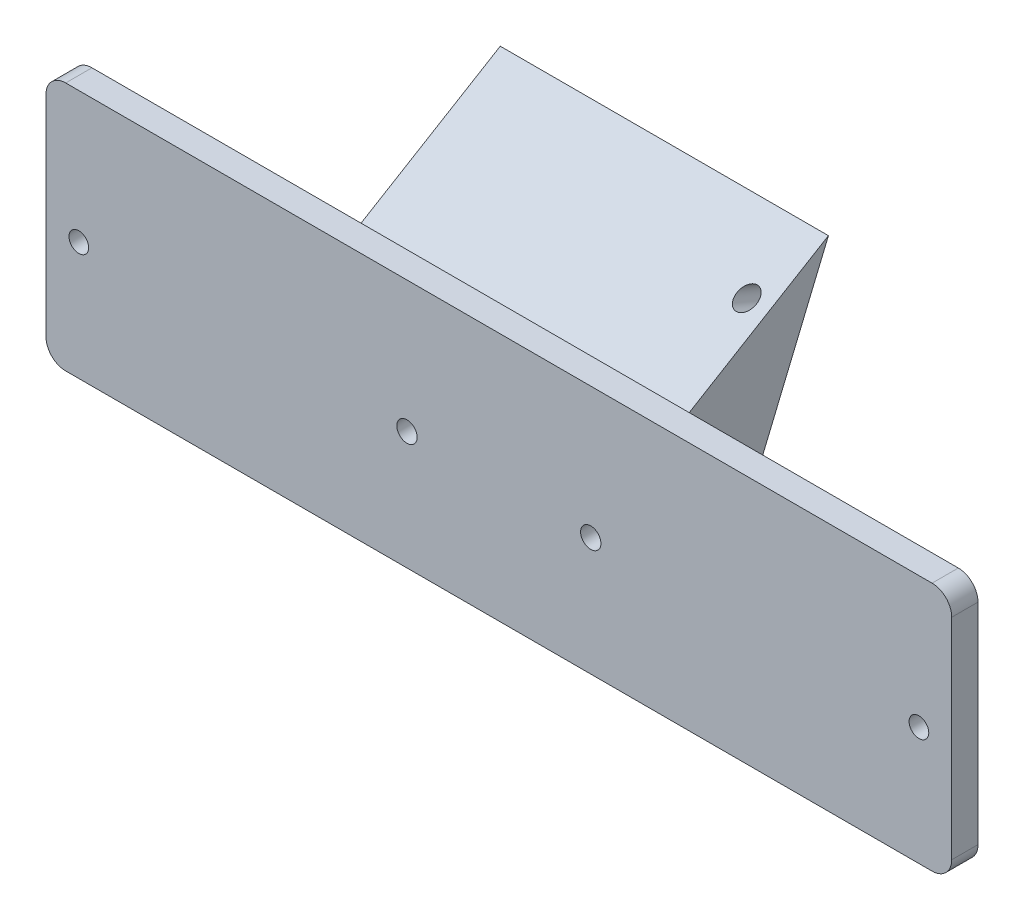
ISO-10303-21;
HEADER;
FILE_DESCRIPTION(('STEP AP214'),'2;1');
FILE_NAME('part.step','',(''),(''),'','','');
FILE_SCHEMA(('AUTOMOTIVE_DESIGN { 1 0 10303 214 1 1 1 1 }'));
ENDSEC;
DATA;
#1=APPLICATION_CONTEXT('core data for automotive mechanical design processes');
#2=APPLICATION_PROTOCOL_DEFINITION('international standard','automotive_design',2000,#1);
#3=PRODUCT_CONTEXT('',#1,'mechanical');
#4=PRODUCT('Part','Part','',(#3));
#5=PRODUCT_RELATED_PRODUCT_CATEGORY('part','',(#4));
#6=PRODUCT_DEFINITION_FORMATION('','',#4);
#7=PRODUCT_DEFINITION_CONTEXT('part definition',#1,'design');
#8=PRODUCT_DEFINITION('design','',#6,#7);
#9=PRODUCT_DEFINITION_SHAPE('','',#8);
#10=(LENGTH_UNIT() NAMED_UNIT(*) SI_UNIT(.MILLI.,.METRE.));
#11=(NAMED_UNIT(*) PLANE_ANGLE_UNIT() SI_UNIT($,.RADIAN.));
#12=(NAMED_UNIT(*) SI_UNIT($,.STERADIAN.) SOLID_ANGLE_UNIT());
#13=UNCERTAINTY_MEASURE_WITH_UNIT(LENGTH_MEASURE(1.E-05),#10,'distance_accuracy_value','');
#14=(GEOMETRIC_REPRESENTATION_CONTEXT(3) GLOBAL_UNCERTAINTY_ASSIGNED_CONTEXT((#13)) GLOBAL_UNIT_ASSIGNED_CONTEXT((#10,
#11,#12)) REPRESENTATION_CONTEXT('',''));
#15=CARTESIAN_POINT('',(0.,0.,0.));
#16=DIRECTION('',(0.,0.,1.));
#17=DIRECTION('',(1.,0.,0.));
#18=AXIS2_PLACEMENT_3D('',#15,#16,#17);
#19=CARTESIAN_POINT('',(14.,-1.00000000000002,-14.));
#20=DIRECTION('',(0.,0.,1.));
#21=DIRECTION('',(1.,0.,0.));
#22=AXIS2_PLACEMENT_3D('',#19,#20,#21);
#23=CYLINDRICAL_SURFACE('',#22,4.);
#24=CARTESIAN_POINT('',(14.,-1.00000000000002,-7.52401281736873));
#25=DIRECTION('',(0.,-0.385663901816188,-0.922639341690952));
#26=DIRECTION('',(0.,-0.922639341690952,0.385663901816188));
#27=AXIS2_PLACEMENT_3D('',#24,#25,#26);
#28=ELLIPSE('',#27,4.33538850908857,4.);
#29=CARTESIAN_POINT('',(14.,-5.00000000000002,-5.85200996906457));
#30=VERTEX_POINT('',#29);
#31=EDGE_CURVE('E245',#30,#30,#28,.T.);
#32=ORIENTED_EDGE('',*,*,#31,.T.);
#33=EDGE_LOOP('',(#32));
#34=FACE_BOUND('',#33,.T.);
#35=CARTESIAN_POINT('',(13.548857522689,-4.97447738264615,0.));
#36=CARTESIAN_POINT('',(13.5508289934858,-4.97468866420865,-0.135695678189096));
#37=CARTESIAN_POINT('',(13.5502356291193,-4.97463159092735,-0.271441588218893));
#38=CARTESIAN_POINT('',(13.5435951268503,-4.97388131099325,-0.542924316141424));
#39=CARTESIAN_POINT('',(13.5375428347743,-4.97318750314186,-0.678661004174361));
#40=CARTESIAN_POINT('',(13.5195823218966,-4.97105487501132,-0.950866301817778));
#41=CARTESIAN_POINT('',(13.5076266389618,-4.96961001133758,-1.08733182496762));
#42=CARTESIAN_POINT('',(13.4771804617153,-4.96571502150153,-1.35946274120574));
#43=CARTESIAN_POINT('',(13.4586928024603,-4.9632653313873,-1.49512845550229));
#44=CARTESIAN_POINT('',(13.4126553341946,-4.95671887891971,-1.77395237818587));
#45=CARTESIAN_POINT('',(13.3845974935782,-4.95252598476532,-1.91702879459859));
#46=CARTESIAN_POINT('',(13.3341929359118,-4.94423374129124,-2.12950783379239));
#47=CARTESIAN_POINT('',(13.3160169587779,-4.94113801507408,-2.1999414570889));
#48=CARTESIAN_POINT('',(13.2763585935264,-4.93405045428112,-2.33981844774629));
#49=CARTESIAN_POINT('',(13.2548772401017,-4.93005889995068,-2.40926211758817));
#50=CARTESIAN_POINT('',(13.2049759248958,-4.92028867770833,-2.55514629751047));
#51=CARTESIAN_POINT('',(13.1760276623927,-4.91435065927322,-2.63139775939005));
#52=CARTESIAN_POINT('',(13.1113719007689,-4.90018705562004,-2.78083728416944));
#53=CARTESIAN_POINT('',(13.0756708688848,-4.89196365564132,-2.8540281969763));
#54=CARTESIAN_POINT('',(13.0115504810974,-4.87602194308785,-2.96503383372171));
#55=CARTESIAN_POINT('',(12.9863243816257,-4.86952909498467,-3.00484854506988));
#56=CARTESIAN_POINT('',(12.9316812797524,-4.85480256264338,-3.0812088140369));
#57=CARTESIAN_POINT('',(12.9022690584792,-4.84657085929455,-3.11775802483608));
#58=CARTESIAN_POINT('',(12.8486863764008,-4.83079337441657,-3.17427085002743));
#59=CARTESIAN_POINT('',(12.8259429037748,-4.82390216956617,-3.19575186105137));
#60=CARTESIAN_POINT('',(12.7778351342796,-4.80879855273373,-3.23502108843322));
#61=CARTESIAN_POINT('',(12.7524758338314,-4.80058864344554,-3.25281615648946));
#62=CARTESIAN_POINT('',(12.7052873761329,-4.78473097665914,-3.27972678703418));
#63=CARTESIAN_POINT('',(12.6839665804758,-4.77737983433383,-3.28989585554295));
#64=CARTESIAN_POINT('',(12.6401673017082,-4.7618336873964,-3.30634972981019));
#65=CARTESIAN_POINT('',(12.6176903361921,-4.75363977555732,-3.3126394933811));
#66=CARTESIAN_POINT('',(12.5721032621388,-4.73653645598424,-3.32085578683037));
#67=CARTESIAN_POINT('',(12.5489910093077,-4.72762435834528,-3.32276504114623));
#68=CARTESIAN_POINT('',(12.5029816736419,-4.70938679809966,-3.32217572773031));
#69=CARTESIAN_POINT('',(12.480084821932,-4.7000609419037,-3.3196728713573));
#70=CARTESIAN_POINT('',(12.4302348487773,-4.67922789673592,-3.30977646023281));
#71=CARTESIAN_POINT('',(12.4034879942459,-4.66768913757895,-3.30143415361625));
#72=CARTESIAN_POINT('',(12.3518000943537,-4.64475536673794,-3.28024340163977));
#73=CARTESIAN_POINT('',(12.3268624442596,-4.63336065685782,-3.26738673548343));
#74=CARTESIAN_POINT('',(12.2624385180174,-4.60317620985692,-3.22846873755759));
#75=CARTESIAN_POINT('',(12.2246740301995,-4.58466179431027,-3.19939178721659));
#76=CARTESIAN_POINT('',(12.1536191076803,-4.54858707426575,-3.1357398804736));
#77=CARTESIAN_POINT('',(12.1203440986552,-4.53103017696242,-3.10114681660133));
#78=CARTESIAN_POINT('',(12.0425826695868,-4.48873878976479,-3.01156043327986));
#79=CARTESIAN_POINT('',(12.0001340303818,-4.46448903419513,-2.95459452015534));
#80=CARTESIAN_POINT('',(11.9205791358987,-4.41732895754569,-2.83647277381761));
#81=CARTESIAN_POINT('',(11.8834853836926,-4.39442184309761,-2.7753076114966));
#82=CARTESIAN_POINT('',(11.8129717481283,-4.34942860851124,-2.64969753127713));
#83=CARTESIAN_POINT('',(11.7795945275513,-4.32735363361262,-2.58522492049222));
#84=CARTESIAN_POINT('',(11.7160805784369,-4.28408019429434,-2.45453741456654));
#85=CARTESIAN_POINT('',(11.6859402653108,-4.26288077662987,-2.38832454993401));
#86=CARTESIAN_POINT('',(11.6161509513254,-4.2124476717109,-2.22662663090242));
#87=CARTESIAN_POINT('',(11.5777953178162,-4.18356079543308,-2.13047770845679));
#88=CARTESIAN_POINT('',(11.5050292623399,-4.12685804056314,-1.93637563948792));
#89=CARTESIAN_POINT('',(11.470620075752,-4.09904249913711,-1.83842193908136));
#90=CARTESIAN_POINT('',(11.4049253660648,-4.0442437129652,-1.64102425792748));
#91=CARTESIAN_POINT('',(11.3736460137535,-4.01726218218666,-1.54157776104571));
#92=CARTESIAN_POINT('',(11.3137418539156,-3.96405475770039,-1.34168698729726));
#93=CARTESIAN_POINT('',(11.285117199499,-3.93782890763669,-1.24124265324965));
#94=CARTESIAN_POINT('',(11.231955968682,-3.88776288869805,-1.04625860411516));
#95=CARTESIAN_POINT('',(11.2072741648165,-3.86387987866721,-0.951769266167051));
#96=CARTESIAN_POINT('',(11.1596417098097,-3.81664503004408,-0.762219624701112));
#97=CARTESIAN_POINT('',(11.1366911385143,-3.79329321598565,-0.667159295066688));
#98=CARTESIAN_POINT('',(11.0924282544889,-3.74718844449116,-0.476977131696383));
#99=CARTESIAN_POINT('',(11.0711092201527,-3.7244333158064,-0.381857382526275));
#100=CARTESIAN_POINT('',(11.0298589223531,-3.67940080046702,-0.191216861172352));
#101=CARTESIAN_POINT('',(11.0099274939587,-3.65712335725319,-0.0956961380843129));
#102=CARTESIAN_POINT('',(10.9906173019458,-3.63507415012405,0.));
#103=B_SPLINE_CURVE_WITH_KNOTS('',3,(#35,#36,#37,#38,#39,#40,#41,#42,#43,#44,#45,#46,#47,#48,
#49,#50,#51,#52,#53,#54,#55,#56,#57,#58,#59,#60,#61,#62,#63,#64,#65,#66,#67,#68,#69,#70,#71,#72,
#73,#74,#75,#76,#77,#78,#79,#80,#81,#82,#83,#84,#85,#86,#87,#88,#89,#90,#91,#92,#93,#94,#95,#96,
#97,#98,#99,#100,#101,#102),.UNSPECIFIED.,.F.,.F.,(4,2,2,2,2,2,2,2,2,2,2,2,2,2,2,2,2,2,2,2,2,2,
2,2,2,2,2,2,2,2,2,2,2,4),(0.,0.407123518449141,0.814631834881879,1.22547113499973,
1.63613233821117,2.07330802279186,2.29166435922415,2.50995248138173,2.75506938843174,
2.99995272090053,3.14248382974126,3.28485343564211,3.3807086508683,3.47638405191943,
3.55030564697157,3.62413257223935,3.69825015445158,3.77243981985319,3.86283262508824,
3.9533908996504,4.10591795758554,4.2589564259962,4.48359152200211,4.70874291508251,
4.93625827502425,5.16351902574743,5.48580029948024,5.80818218500554,6.13118764817672,
6.45421172915004,6.75580489173056,7.05741195555207,7.35770084940138,7.65795398970193),.UNSPECIFIED.);
#104=CARTESIAN_POINT('',(13.548857522689,-4.97447738264613,0.));
#105=VERTEX_POINT('',#104);
#106=CARTESIAN_POINT('',(10.9906173019458,-3.63507415012401,0.));
#107=VERTEX_POINT('',#106);
#108=EDGE_CURVE('E47',#105,#107,#103,.T.);
#109=ORIENTED_EDGE('',*,*,#108,.F.);
#110=CARTESIAN_POINT('',(14.,-1.00000000000002,0.));
#111=DIRECTION('',(0.,0.,1.));
#112=DIRECTION('',(1.,0.,0.));
#113=AXIS2_PLACEMENT_3D('',#110,#111,#112);
#114=CIRCLE('',#113,4.);
#115=EDGE_CURVE('E125',#105,#107,#114,.T.);
#116=ORIENTED_EDGE('',*,*,#115,.T.);
#117=EDGE_LOOP('',(#109,#116));
#118=FACE_BOUND('',#117,.T.);
#119=ADVANCED_FACE('F33',(#34,#118),#23,.F.);
#120=CARTESIAN_POINT('',(-14.,-0.999999999999997,48.));
#121=DIRECTION('',(0.,0.,-1.));
#122=DIRECTION('',(-1.,0.,0.));
#123=AXIS2_PLACEMENT_3D('',#120,#121,#122);
#124=CYLINDRICAL_SURFACE('',#123,1.55);
#125=CARTESIAN_POINT('',(-14.,-0.999999999999997,4.));
#126=DIRECTION('',(0.,0.,1.));
#127=DIRECTION('',(1.,0.,0.));
#128=AXIS2_PLACEMENT_3D('',#125,#126,#127);
#129=CIRCLE('',#128,1.55);
#130=CARTESIAN_POINT('',(-12.45,-0.999999999999997,4.));
#131=VERTEX_POINT('',#130);
#132=EDGE_CURVE('E152',#131,#131,#129,.F.);
#133=ORIENTED_EDGE('',*,*,#132,.F.);
#134=EDGE_LOOP('',(#133));
#135=FACE_BOUND('',#134,.T.);
#136=CARTESIAN_POINT('',(-14.,-0.999999999999997,0.));
#137=DIRECTION('',(0.,0.,-1.));
#138=DIRECTION('',(-1.,0.,0.));
#139=AXIS2_PLACEMENT_3D('',#136,#137,#138);
#140=CIRCLE('',#139,1.55);
#141=CARTESIAN_POINT('',(-15.55,-0.999999999999997,0.));
#142=VERTEX_POINT('',#141);
#143=EDGE_CURVE('E131',#142,#142,#140,.T.);
#144=ORIENTED_EDGE('',*,*,#143,.T.);
#145=EDGE_LOOP('',(#144));
#146=FACE_BOUND('',#145,.T.);
#147=ADVANCED_FACE('F296',(#135,#146),#124,.F.);
#148=CARTESIAN_POINT('',(-25.,-19.,0.));
#149=DIRECTION('',(0.,-0.385663901816188,-0.922639341690952));
#150=DIRECTION('',(0.,0.922639341690952,-0.385663901816188));
#151=AXIS2_PLACEMENT_3D('',#148,#149,#150);
#152=PLANE('',#151);
#153=CARTESIAN_POINT('',(-22.,-7.00568855801762,-5.01363072361044));
#154=DIRECTION('',(0.,-0.385663901816188,-0.922639341690952));
#155=DIRECTION('',(0.,0.922639341690952,-0.385663901816188));
#156=AXIS2_PLACEMENT_3D('',#153,#154,#155);
#157=CIRCLE('',#156,1.55);
#158=CARTESIAN_POINT('',(-22.,-5.57559757839665,-5.61140977142553));
#159=VERTEX_POINT('',#158);
#160=EDGE_CURVE('E37',#159,#159,#157,.F.);
#161=ORIENTED_EDGE('',*,*,#160,.T.);
#162=EDGE_LOOP('',(#161));
#163=FACE_BOUND('',#162,.T.);
#164=CARTESIAN_POINT('',(12.,-7.00568855801763,-5.01363072361044));
#165=DIRECTION('',(0.,-0.385663901816188,-0.922639341690952));
#166=DIRECTION('',(0.,0.922639341690952,-0.385663901816188));
#167=AXIS2_PLACEMENT_3D('',#164,#165,#166);
#168=CIRCLE('',#167,1.55);
#169=CARTESIAN_POINT('',(12.,-5.57559757839665,-5.61140977142553));
#170=VERTEX_POINT('',#169);
#171=EDGE_CURVE('E126',#170,#170,#168,.F.);
#172=ORIENTED_EDGE('',*,*,#171,.T.);
#173=EDGE_LOOP('',(#172));
#174=FACE_BOUND('',#173,.T.);
#175=CARTESIAN_POINT('',(21.6,23.9027293886293,-17.9333714344527));
#176=DIRECTION('',(0.,-0.385663901816188,-0.922639341690952));
#177=DIRECTION('',(0.,0.922639341690952,-0.385663901816188));
#178=AXIS2_PLACEMENT_3D('',#175,#176,#177);
#179=CIRCLE('',#178,1.5);
#180=CARTESIAN_POINT('',(21.6,25.2866884011657,-18.511867287177));
#181=VERTEX_POINT('',#180);
#182=EDGE_CURVE('E141',#181,#181,#179,.T.);
#183=ORIENTED_EDGE('',*,*,#182,.F.);
#184=EDGE_LOOP('',(#183));
#185=FACE_BOUND('',#184,.T.);
#186=ORIENTED_EDGE('',*,*,#31,.F.);
#187=EDGE_LOOP('',(#186));
#188=FACE_BOUND('',#187,.T.);
#189=CARTESIAN_POINT('',(-14.,-1.00000000000002,-7.52401281736873));
#190=DIRECTION('',(0.,-0.385663901816188,-0.922639341690952));
#191=DIRECTION('',(0.,-0.922639341690952,0.385663901816188));
#192=AXIS2_PLACEMENT_3D('',#189,#190,#191);
#193=ELLIPSE('',#192,4.33538850908857,4.);
#194=CARTESIAN_POINT('',(-14.,-5.00000000000002,-5.85200996906457));
#195=VERTEX_POINT('',#194);
#196=EDGE_CURVE('E250',#195,#195,#193,.T.);
#197=ORIENTED_EDGE('',*,*,#196,.F.);
#198=EDGE_LOOP('',(#197));
#199=FACE_BOUND('',#198,.T.);
#200=DIRECTION('',(1.,0.,0.));
#201=VECTOR('',#200,1.);
#202=CARTESIAN_POINT('',(-25.,31.7451637930024,-21.2115145998903));
#203=LINE('',#202,#201);
#204=CARTESIAN_POINT('',(-25.,31.7451637930024,-21.2115145998903));
#205=VERTEX_POINT('',#204);
#206=CARTESIAN_POINT('',(25.,31.7451637930024,-21.2115145998903));
#207=VERTEX_POINT('',#206);
#208=EDGE_CURVE('E166',#205,#207,#203,.T.);
#209=ORIENTED_EDGE('',*,*,#208,.T.);
#210=DIRECTION('',(0.,0.922639341690952,-0.385663901816188));
#211=VECTOR('',#210,1.);
#212=CARTESIAN_POINT('',(25.,31.7451637930024,-21.2115145998903));
#213=LINE('',#212,#211);
#214=CARTESIAN_POINT('',(25.,-19.,0.));
#215=VERTEX_POINT('',#214);
#216=EDGE_CURVE('E55',#215,#207,#213,.T.);
#217=ORIENTED_EDGE('',*,*,#216,.F.);
#218=DIRECTION('',(1.,0.,0.));
#219=VECTOR('',#218,1.);
#220=CARTESIAN_POINT('',(-25.,-19.,0.));
#221=LINE('',#220,#219);
#222=CARTESIAN_POINT('',(-25.,-19.,0.));
#223=VERTEX_POINT('',#222);
#224=EDGE_CURVE('E165',#223,#215,#221,.T.);
#225=ORIENTED_EDGE('',*,*,#224,.F.);
#226=DIRECTION('',(0.,0.922639341690952,-0.385663901816188));
#227=VECTOR('',#226,1.);
#228=CARTESIAN_POINT('',(-25.,-19.,0.));
#229=LINE('',#228,#227);
#230=EDGE_CURVE('E159',#223,#205,#229,.T.);
#231=ORIENTED_EDGE('',*,*,#230,.T.);
#232=EDGE_LOOP('',(#209,#217,#225,#231));
#233=FACE_BOUND('',#232,.T.);
#234=ADVANCED_FACE('F301',(#163,#174,#185,#188,#199,#233),#152,.T.);
#235=CARTESIAN_POINT('',(-25.,31.7451637930024,-21.2115145998903));
#236=DIRECTION('',(0.,0.85716730070211,0.515038074910058));
#237=DIRECTION('',(0.,-0.515038074910058,0.85716730070211));
#238=AXIS2_PLACEMENT_3D('',#235,#236,#237);
#239=PLANE('',#238);
#240=CARTESIAN_POINT('',(21.6,26.3120898255097,-12.1693610696997));
#241=DIRECTION('',(0.,0.85716730070211,0.515038074910058));
#242=DIRECTION('',(0.,0.515038074910058,-0.85716730070211));
#243=AXIS2_PLACEMENT_3D('',#240,#241,#242);
#244=ELLIPSE('',#243,1.86156675724746,1.5);
#245=CARTESIAN_POINT('',(21.6,27.270867584479,-13.7650352220863));
#246=VERTEX_POINT('',#245);
#247=EDGE_CURVE('E138',#246,#246,#244,.T.);
#248=ORIENTED_EDGE('',*,*,#247,.F.);
#249=EDGE_LOOP('',(#248));
#250=FACE_BOUND('',#249,.T.);
#251=DIRECTION('',(-1.,0.,0.));
#252=VECTOR('',#251,1.);
#253=CARTESIAN_POINT('',(-66.,19.,0.));
#254=LINE('',#253,#252);
#255=CARTESIAN_POINT('',(25.,19.,0.));
#256=VERTEX_POINT('',#255);
#257=CARTESIAN_POINT('',(-25.,19.,0.));
#258=VERTEX_POINT('',#257);
#259=EDGE_CURVE('E208',#256,#258,#254,.T.);
#260=ORIENTED_EDGE('',*,*,#259,.F.);
#261=DIRECTION('',(0.,-0.515038074910058,0.85716730070211));
#262=VECTOR('',#261,1.);
#263=CARTESIAN_POINT('',(25.,19.,0.));
#264=LINE('',#263,#262);
#265=EDGE_CURVE('E145',#207,#256,#264,.T.);
#266=ORIENTED_EDGE('',*,*,#265,.F.);
#267=ORIENTED_EDGE('',*,*,#208,.F.);
#268=DIRECTION('',(0.,-0.515038074910058,0.85716730070211));
#269=VECTOR('',#268,1.);
#270=CARTESIAN_POINT('',(-25.,31.7451637930024,-21.2115145998903));
#271=LINE('',#270,#269);
#272=EDGE_CURVE('E162',#205,#258,#271,.T.);
#273=ORIENTED_EDGE('',*,*,#272,.T.);
#274=EDGE_LOOP('',(#260,#266,#267,#273));
#275=FACE_BOUND('',#274,.T.);
#276=ADVANCED_FACE('F308',(#250,#275),#239,.T.);
#277=CARTESIAN_POINT('',(66.,-16.,4.));
#278=DIRECTION('',(0.,0.,-1.));
#279=DIRECTION('',(-1.,0.,0.));
#280=AXIS2_PLACEMENT_3D('',#277,#278,#279);
#281=CYLINDRICAL_SURFACE('',#280,3.);
#282=CARTESIAN_POINT('',(66.,-16.,0.));
#283=DIRECTION('',(0.,0.,1.));
#284=DIRECTION('',(1.,0.,0.));
#285=AXIS2_PLACEMENT_3D('',#282,#283,#284);
#286=CIRCLE('',#285,3.);
#287=CARTESIAN_POINT('',(66.,-19.,0.));
#288=VERTEX_POINT('',#287);
#289=CARTESIAN_POINT('',(69.,-16.,0.));
#290=VERTEX_POINT('',#289);
#291=EDGE_CURVE('E178',#288,#290,#286,.T.);
#292=ORIENTED_EDGE('',*,*,#291,.T.);
#293=DIRECTION('',(0.,0.,-1.));
#294=VECTOR('',#293,1.);
#295=CARTESIAN_POINT('',(69.,-16.,4.));
#296=LINE('',#295,#294);
#297=CARTESIAN_POINT('',(69.,-16.,4.));
#298=VERTEX_POINT('',#297);
#299=EDGE_CURVE('E42',#298,#290,#296,.T.);
#300=ORIENTED_EDGE('',*,*,#299,.F.);
#301=CARTESIAN_POINT('',(66.,-16.,4.));
#302=DIRECTION('',(0.,0.,1.));
#303=DIRECTION('',(1.,0.,0.));
#304=AXIS2_PLACEMENT_3D('',#301,#302,#303);
#305=CIRCLE('',#304,3.);
#306=CARTESIAN_POINT('',(66.,-19.,4.));
#307=VERTEX_POINT('',#306);
#308=EDGE_CURVE('E179',#307,#298,#305,.T.);
#309=ORIENTED_EDGE('',*,*,#308,.F.);
#310=DIRECTION('',(0.,0.,-1.));
#311=VECTOR('',#310,1.);
#312=CARTESIAN_POINT('',(66.,-19.,4.));
#313=LINE('',#312,#311);
#314=EDGE_CURVE('E197',#307,#288,#313,.T.);
#315=ORIENTED_EDGE('',*,*,#314,.T.);
#316=EDGE_LOOP('',(#292,#300,#309,#315));
#317=FACE_BOUND('',#316,.T.);
#318=ADVANCED_FACE('F35',(#317),#281,.T.);
#319=CARTESIAN_POINT('',(69.,-16.,4.));
#320=DIRECTION('',(-1.,0.,0.));
#321=DIRECTION('',(0.,0.,1.));
#322=AXIS2_PLACEMENT_3D('',#319,#320,#321);
#323=PLANE('',#322);
#324=ORIENTED_EDGE('',*,*,#299,.T.);
#325=DIRECTION('',(0.,-1.,0.));
#326=VECTOR('',#325,1.);
#327=CARTESIAN_POINT('',(69.,-19.,0.));
#328=LINE('',#327,#326);
#329=CARTESIAN_POINT('',(69.,16.,0.));
#330=VERTEX_POINT('',#329);
#331=EDGE_CURVE('E146',#330,#290,#328,.T.);
#332=ORIENTED_EDGE('',*,*,#331,.F.);
#333=DIRECTION('',(0.,0.,-1.));
#334=VECTOR('',#333,1.);
#335=CARTESIAN_POINT('',(69.,16.,4.));
#336=LINE('',#335,#334);
#337=CARTESIAN_POINT('',(69.,16.,4.));
#338=VERTEX_POINT('',#337);
#339=EDGE_CURVE('E233',#338,#330,#336,.T.);
#340=ORIENTED_EDGE('',*,*,#339,.F.);
#341=DIRECTION('',(0.,1.,0.));
#342=VECTOR('',#341,1.);
#343=CARTESIAN_POINT('',(69.,-16.,4.));
#344=LINE('',#343,#342);
#345=EDGE_CURVE('E182',#298,#338,#344,.T.);
#346=ORIENTED_EDGE('',*,*,#345,.F.);
#347=EDGE_LOOP('',(#324,#332,#340,#346));
#348=FACE_BOUND('',#347,.T.);
#349=ADVANCED_FACE('F388',(#348),#323,.F.);
#350=CARTESIAN_POINT('',(66.,16.,4.));
#351=DIRECTION('',(0.,0.,-1.));
#352=DIRECTION('',(-1.,0.,0.));
#353=AXIS2_PLACEMENT_3D('',#350,#351,#352);
#354=CYLINDRICAL_SURFACE('',#353,3.);
#355=CARTESIAN_POINT('',(66.,16.,0.));
#356=DIRECTION('',(0.,0.,1.));
#357=DIRECTION('',(-1.,0.,0.));
#358=AXIS2_PLACEMENT_3D('',#355,#356,#357);
#359=CIRCLE('',#358,3.);
#360=CARTESIAN_POINT('',(66.,19.,0.));
#361=VERTEX_POINT('',#360);
#362=EDGE_CURVE('E200',#330,#361,#359,.T.);
#363=ORIENTED_EDGE('',*,*,#362,.T.);
#364=DIRECTION('',(0.,0.,-1.));
#365=VECTOR('',#364,1.);
#366=CARTESIAN_POINT('',(66.,19.,4.));
#367=LINE('',#366,#365);
#368=CARTESIAN_POINT('',(66.,19.,4.));
#369=VERTEX_POINT('',#368);
#370=EDGE_CURVE('E230',#369,#361,#367,.T.);
#371=ORIENTED_EDGE('',*,*,#370,.F.);
#372=CARTESIAN_POINT('',(66.,16.,4.));
#373=DIRECTION('',(0.,0.,1.));
#374=DIRECTION('',(-1.,0.,0.));
#375=AXIS2_PLACEMENT_3D('',#372,#373,#374);
#376=CIRCLE('',#375,3.);
#377=EDGE_CURVE('E185',#338,#369,#376,.T.);
#378=ORIENTED_EDGE('',*,*,#377,.F.);
#379=ORIENTED_EDGE('',*,*,#339,.T.);
#380=EDGE_LOOP('',(#363,#371,#378,#379));
#381=FACE_BOUND('',#380,.T.);
#382=ADVANCED_FACE('F385',(#381),#354,.T.);
#383=CARTESIAN_POINT('',(-66.,19.,4.));
#384=DIRECTION('',(0.,-1.,0.));
#385=DIRECTION('',(0.,0.,-1.));
#386=AXIS2_PLACEMENT_3D('',#383,#384,#385);
#387=PLANE('',#386);
#388=EDGE_CURVE('E204',#361,#256,#254,.T.);
#389=ORIENTED_EDGE('',*,*,#388,.T.);
#390=ORIENTED_EDGE('',*,*,#259,.T.);
#391=CARTESIAN_POINT('',(-66.,19.,0.));
#392=VERTEX_POINT('',#391);
#393=EDGE_CURVE('E203',#258,#392,#254,.T.);
#394=ORIENTED_EDGE('',*,*,#393,.T.);
#395=DIRECTION('',(0.,0.,-1.));
#396=VECTOR('',#395,1.);
#397=CARTESIAN_POINT('',(-66.,19.,4.));
#398=LINE('',#397,#396);
#399=CARTESIAN_POINT('',(-66.,19.,4.));
#400=VERTEX_POINT('',#399);
#401=EDGE_CURVE('E227',#400,#392,#398,.T.);
#402=ORIENTED_EDGE('',*,*,#401,.F.);
#403=DIRECTION('',(-1.,0.,0.));
#404=VECTOR('',#403,1.);
#405=CARTESIAN_POINT('',(-66.,19.,4.));
#406=LINE('',#405,#404);
#407=EDGE_CURVE('E187',#369,#400,#406,.T.);
#408=ORIENTED_EDGE('',*,*,#407,.F.);
#409=ORIENTED_EDGE('',*,*,#370,.T.);
#410=EDGE_LOOP('',(#389,#390,#394,#402,#408,#409));
#411=FACE_BOUND('',#410,.T.);
#412=ADVANCED_FACE('F381',(#411),#387,.F.);
#413=CARTESIAN_POINT('',(-66.,16.,4.));
#414=DIRECTION('',(0.,0.,-1.));
#415=DIRECTION('',(-1.,0.,0.));
#416=AXIS2_PLACEMENT_3D('',#413,#414,#415);
#417=CYLINDRICAL_SURFACE('',#416,3.);
#418=CARTESIAN_POINT('',(-66.,16.,0.));
#419=DIRECTION('',(0.,0.,1.));
#420=DIRECTION('',(-1.,0.,0.));
#421=AXIS2_PLACEMENT_3D('',#418,#419,#420);
#422=CIRCLE('',#421,3.);
#423=CARTESIAN_POINT('',(-69.,16.,0.));
#424=VERTEX_POINT('',#423);
#425=EDGE_CURVE('E207',#392,#424,#422,.T.);
#426=ORIENTED_EDGE('',*,*,#425,.T.);
#427=DIRECTION('',(0.,0.,-1.));
#428=VECTOR('',#427,1.);
#429=CARTESIAN_POINT('',(-69.,16.,4.));
#430=LINE('',#429,#428);
#431=CARTESIAN_POINT('',(-69.,16.,4.));
#432=VERTEX_POINT('',#431);
#433=EDGE_CURVE('E224',#432,#424,#430,.T.);
#434=ORIENTED_EDGE('',*,*,#433,.F.);
#435=CARTESIAN_POINT('',(-66.,16.,4.));
#436=DIRECTION('',(0.,0.,1.));
#437=DIRECTION('',(-1.,0.,0.));
#438=AXIS2_PLACEMENT_3D('',#435,#436,#437);
#439=CIRCLE('',#438,3.);
#440=EDGE_CURVE('E189',#400,#432,#439,.T.);
#441=ORIENTED_EDGE('',*,*,#440,.F.);
#442=ORIENTED_EDGE('',*,*,#401,.T.);
#443=EDGE_LOOP('',(#426,#434,#441,#442));
#444=FACE_BOUND('',#443,.T.);
#445=ADVANCED_FACE('F377',(#444),#417,.T.);
#446=CARTESIAN_POINT('',(-69.,-16.,4.));
#447=DIRECTION('',(1.,0.,0.));
#448=DIRECTION('',(0.,0.,-1.));
#449=AXIS2_PLACEMENT_3D('',#446,#447,#448);
#450=PLANE('',#449);
#451=DIRECTION('',(0.,-1.,0.));
#452=VECTOR('',#451,1.);
#453=CARTESIAN_POINT('',(-69.,-16.,0.));
#454=LINE('',#453,#452);
#455=CARTESIAN_POINT('',(-69.,-16.,0.));
#456=VERTEX_POINT('',#455);
#457=EDGE_CURVE('E210',#424,#456,#454,.T.);
#458=ORIENTED_EDGE('',*,*,#457,.T.);
#459=DIRECTION('',(0.,0.,-1.));
#460=VECTOR('',#459,1.);
#461=CARTESIAN_POINT('',(-69.,-16.,4.));
#462=LINE('',#461,#460);
#463=CARTESIAN_POINT('',(-69.,-16.,4.));
#464=VERTEX_POINT('',#463);
#465=EDGE_CURVE('E221',#464,#456,#462,.T.);
#466=ORIENTED_EDGE('',*,*,#465,.F.);
#467=DIRECTION('',(0.,-1.,0.));
#468=VECTOR('',#467,1.);
#469=CARTESIAN_POINT('',(-69.,-16.,4.));
#470=LINE('',#469,#468);
#471=EDGE_CURVE('E191',#432,#464,#470,.T.);
#472=ORIENTED_EDGE('',*,*,#471,.F.);
#473=ORIENTED_EDGE('',*,*,#433,.T.);
#474=EDGE_LOOP('',(#458,#466,#472,#473));
#475=FACE_BOUND('',#474,.T.);
#476=ADVANCED_FACE('F374',(#475),#450,.F.);
#477=CARTESIAN_POINT('',(-66.,-16.,4.));
#478=DIRECTION('',(0.,0.,-1.));
#479=DIRECTION('',(-1.,0.,0.));
#480=AXIS2_PLACEMENT_3D('',#477,#478,#479);
#481=CYLINDRICAL_SURFACE('',#480,3.);
#482=CARTESIAN_POINT('',(-66.,-16.,0.));
#483=DIRECTION('',(0.,0.,1.));
#484=DIRECTION('',(-1.,0.,0.));
#485=AXIS2_PLACEMENT_3D('',#482,#483,#484);
#486=CIRCLE('',#485,3.);
#487=CARTESIAN_POINT('',(-66.,-19.,0.));
#488=VERTEX_POINT('',#487);
#489=EDGE_CURVE('E212',#456,#488,#486,.T.);
#490=ORIENTED_EDGE('',*,*,#489,.T.);
#491=DIRECTION('',(0.,0.,-1.));
#492=VECTOR('',#491,1.);
#493=CARTESIAN_POINT('',(-66.,-19.,4.));
#494=LINE('',#493,#492);
#495=CARTESIAN_POINT('',(-66.,-19.,4.));
#496=VERTEX_POINT('',#495);
#497=EDGE_CURVE('E218',#496,#488,#494,.T.);
#498=ORIENTED_EDGE('',*,*,#497,.F.);
#499=CARTESIAN_POINT('',(-66.,-16.,4.));
#500=DIRECTION('',(0.,0.,1.));
#501=DIRECTION('',(-1.,0.,0.));
#502=AXIS2_PLACEMENT_3D('',#499,#500,#501);
#503=CIRCLE('',#502,3.);
#504=EDGE_CURVE('E193',#464,#496,#503,.T.);
#505=ORIENTED_EDGE('',*,*,#504,.F.);
#506=ORIENTED_EDGE('',*,*,#465,.T.);
#507=EDGE_LOOP('',(#490,#498,#505,#506));
#508=FACE_BOUND('',#507,.T.);
#509=ADVANCED_FACE('F371',(#508),#481,.T.);
#510=CARTESIAN_POINT('',(-66.,-19.,4.));
#511=DIRECTION('',(0.,1.,0.));
#512=DIRECTION('',(0.,0.,1.));
#513=AXIS2_PLACEMENT_3D('',#510,#511,#512);
#514=PLANE('',#513);
#515=DIRECTION('',(1.,0.,0.));
#516=VECTOR('',#515,1.);
#517=CARTESIAN_POINT('',(-66.,-19.,0.));
#518=LINE('',#517,#516);
#519=EDGE_CURVE('E183',#488,#223,#518,.T.);
#520=ORIENTED_EDGE('',*,*,#519,.T.);
#521=ORIENTED_EDGE('',*,*,#224,.T.);
#522=DIRECTION('',(1.,0.,0.));
#523=VECTOR('',#522,1.);
#524=CARTESIAN_POINT('',(25.,-19.,0.));
#525=LINE('',#524,#523);
#526=EDGE_CURVE('E150',#215,#288,#525,.T.);
#527=ORIENTED_EDGE('',*,*,#526,.T.);
#528=ORIENTED_EDGE('',*,*,#314,.F.);
#529=DIRECTION('',(1.,0.,0.));
#530=VECTOR('',#529,1.);
#531=CARTESIAN_POINT('',(-66.,-19.,4.));
#532=LINE('',#531,#530);
#533=EDGE_CURVE('E195',#496,#307,#532,.T.);
#534=ORIENTED_EDGE('',*,*,#533,.F.);
#535=ORIENTED_EDGE('',*,*,#497,.T.);
#536=EDGE_LOOP('',(#520,#521,#527,#528,#534,#535));
#537=FACE_BOUND('',#536,.T.);
#538=ADVANCED_FACE('F324',(#537),#514,.F.);
#539=CARTESIAN_POINT('',(66.,-16.,4.));
#540=DIRECTION('',(0.,0.,1.));
#541=DIRECTION('',(1.,0.,0.));
#542=AXIS2_PLACEMENT_3D('',#539,#540,#541);
#543=PLANE('',#542);
#544=ORIENTED_EDGE('',*,*,#132,.T.);
#545=EDGE_LOOP('',(#544));
#546=FACE_BOUND('',#545,.T.);
#547=CARTESIAN_POINT('',(14.,-1.00000000000002,4.));
#548=DIRECTION('',(0.,0.,1.));
#549=DIRECTION('',(1.,0.,0.));
#550=AXIS2_PLACEMENT_3D('',#547,#548,#549);
#551=CIRCLE('',#550,1.55);
#552=CARTESIAN_POINT('',(15.55,-1.00000000000002,4.));
#553=VERTEX_POINT('',#552);
#554=EDGE_CURVE('E242',#553,#553,#551,.F.);
#555=ORIENTED_EDGE('',*,*,#554,.T.);
#556=EDGE_LOOP('',(#555));
#557=FACE_BOUND('',#556,.T.);
#558=CARTESIAN_POINT('',(-64.,-0.999999999999997,4.));
#559=DIRECTION('',(0.,0.,1.));
#560=DIRECTION('',(1.,0.,0.));
#561=AXIS2_PLACEMENT_3D('',#558,#559,#560);
#562=CIRCLE('',#561,1.5);
#563=CARTESIAN_POINT('',(-62.5,-0.999999999999997,4.));
#564=VERTEX_POINT('',#563);
#565=EDGE_CURVE('E175',#564,#564,#562,.F.);
#566=ORIENTED_EDGE('',*,*,#565,.T.);
#567=EDGE_LOOP('',(#566));
#568=FACE_BOUND('',#567,.T.);
#569=CARTESIAN_POINT('',(64.,-0.999999999999997,4.));
#570=DIRECTION('',(0.,0.,1.));
#571=DIRECTION('',(1.,0.,0.));
#572=AXIS2_PLACEMENT_3D('',#569,#570,#571);
#573=CIRCLE('',#572,1.5);
#574=CARTESIAN_POINT('',(65.5,-0.999999999999997,4.));
#575=VERTEX_POINT('',#574);
#576=EDGE_CURVE('E169',#575,#575,#573,.F.);
#577=ORIENTED_EDGE('',*,*,#576,.T.);
#578=EDGE_LOOP('',(#577));
#579=FACE_BOUND('',#578,.T.);
#580=ORIENTED_EDGE('',*,*,#308,.T.);
#581=ORIENTED_EDGE('',*,*,#345,.T.);
#582=ORIENTED_EDGE('',*,*,#377,.T.);
#583=ORIENTED_EDGE('',*,*,#407,.T.);
#584=ORIENTED_EDGE('',*,*,#440,.T.);
#585=ORIENTED_EDGE('',*,*,#471,.T.);
#586=ORIENTED_EDGE('',*,*,#504,.T.);
#587=ORIENTED_EDGE('',*,*,#533,.T.);
#588=EDGE_LOOP('',(#580,#581,#582,#583,#584,#585,#586,#587));
#589=FACE_BOUND('',#588,.T.);
#590=ADVANCED_FACE('F330',(#546,#557,#568,#579,#589),#543,.T.);
#591=CARTESIAN_POINT('',(66.,-16.,0.));
#592=DIRECTION('',(0.,0.,1.));
#593=DIRECTION('',(1.,0.,0.));
#594=AXIS2_PLACEMENT_3D('',#591,#592,#593);
#595=PLANE('',#594);
#596=CARTESIAN_POINT('',(-64.,-0.999999999999997,0.));
#597=DIRECTION('',(0.,0.,1.));
#598=DIRECTION('',(1.,0.,0.));
#599=AXIS2_PLACEMENT_3D('',#596,#597,#598);
#600=CIRCLE('',#599,1.5);
#601=CARTESIAN_POINT('',(-62.5,-0.999999999999997,0.));
#602=VERTEX_POINT('',#601);
#603=EDGE_CURVE('E174',#602,#602,#600,.F.);
#604=ORIENTED_EDGE('',*,*,#603,.F.);
#605=EDGE_LOOP('',(#604));
#606=FACE_BOUND('',#605,.T.);
#607=ORIENTED_EDGE('',*,*,#393,.F.);
#608=DIRECTION('',(0.,-1.,0.));
#609=VECTOR('',#608,1.);
#610=CARTESIAN_POINT('',(-25.,19.,0.));
#611=LINE('',#610,#609);
#612=EDGE_CURVE('E156',#258,#223,#611,.T.);
#613=ORIENTED_EDGE('',*,*,#612,.T.);
#614=ORIENTED_EDGE('',*,*,#519,.F.);
#615=ORIENTED_EDGE('',*,*,#489,.F.);
#616=ORIENTED_EDGE('',*,*,#457,.F.);
#617=ORIENTED_EDGE('',*,*,#425,.F.);
#618=EDGE_LOOP('',(#607,#613,#614,#615,#616,#617));
#619=FACE_BOUND('',#618,.T.);
#620=ADVANCED_FACE('F338',(#606,#619),#595,.F.);
#621=CARTESIAN_POINT('',(64.,-0.999999999999997,13.));
#622=DIRECTION('',(0.,0.,-1.));
#623=DIRECTION('',(-1.,0.,0.));
#624=AXIS2_PLACEMENT_3D('',#621,#622,#623);
#625=CYLINDRICAL_SURFACE('',#624,1.5);
#626=ORIENTED_EDGE('',*,*,#576,.F.);
#627=EDGE_LOOP('',(#626));
#628=FACE_BOUND('',#627,.T.);
#629=CARTESIAN_POINT('',(64.,-0.999999999999997,0.));
#630=DIRECTION('',(0.,0.,1.));
#631=DIRECTION('',(1.,0.,0.));
#632=AXIS2_PLACEMENT_3D('',#629,#630,#631);
#633=CIRCLE('',#632,1.5);
#634=CARTESIAN_POINT('',(65.5,-0.999999999999997,0.));
#635=VERTEX_POINT('',#634);
#636=EDGE_CURVE('E155',#635,#635,#633,.F.);
#637=ORIENTED_EDGE('',*,*,#636,.T.);
#638=EDGE_LOOP('',(#637));
#639=FACE_BOUND('',#638,.T.);
#640=ADVANCED_FACE('F352',(#628,#639),#625,.F.);
#641=CARTESIAN_POINT('',(-64.,-0.999999999999997,13.));
#642=DIRECTION('',(0.,0.,-1.));
#643=DIRECTION('',(-1.,0.,0.));
#644=AXIS2_PLACEMENT_3D('',#641,#642,#643);
#645=CYLINDRICAL_SURFACE('',#644,1.5);
#646=ORIENTED_EDGE('',*,*,#565,.F.);
#647=EDGE_LOOP('',(#646));
#648=FACE_BOUND('',#647,.T.);
#649=ORIENTED_EDGE('',*,*,#603,.T.);
#650=EDGE_LOOP('',(#649));
#651=FACE_BOUND('',#650,.T.);
#652=ADVANCED_FACE('F345',(#648,#651),#645,.F.);
#653=CARTESIAN_POINT('',(-25.,0.,0.));
#654=DIRECTION('',(-1.,0.,0.));
#655=DIRECTION('',(0.,0.,1.));
#656=AXIS2_PLACEMENT_3D('',#653,#654,#655);
#657=PLANE('',#656);
#658=ORIENTED_EDGE('',*,*,#612,.F.);
#659=ORIENTED_EDGE('',*,*,#272,.F.);
#660=ORIENTED_EDGE('',*,*,#230,.F.);
#661=EDGE_LOOP('',(#658,#659,#660));
#662=FACE_BOUND('',#661,.T.);
#663=ADVANCED_FACE('F343',(#662),#657,.T.);
#664=CARTESIAN_POINT('',(25.,-19.,0.));
#665=DIRECTION('',(0.,0.,1.));
#666=DIRECTION('',(1.,0.,0.));
#667=AXIS2_PLACEMENT_3D('',#664,#665,#666);
#668=PLANE('',#667);
#669=ORIENTED_EDGE('',*,*,#526,.F.);
#670=DIRECTION('',(0.,-1.,0.));
#671=VECTOR('',#670,1.);
#672=CARTESIAN_POINT('',(25.,-19.,0.));
#673=LINE('',#672,#671);
#674=EDGE_CURVE('E148',#256,#215,#673,.T.);
#675=ORIENTED_EDGE('',*,*,#674,.F.);
#676=ORIENTED_EDGE('',*,*,#388,.F.);
#677=ORIENTED_EDGE('',*,*,#362,.F.);
#678=ORIENTED_EDGE('',*,*,#331,.T.);
#679=ORIENTED_EDGE('',*,*,#291,.F.);
#680=EDGE_LOOP('',(#669,#675,#676,#677,#678,#679));
#681=FACE_BOUND('',#680,.T.);
#682=ORIENTED_EDGE('',*,*,#636,.F.);
#683=EDGE_LOOP('',(#682));
#684=FACE_BOUND('',#683,.T.);
#685=ADVANCED_FACE('F320',(#681,#684),#668,.F.);
#686=CARTESIAN_POINT('',(25.,0.,0.));
#687=DIRECTION('',(1.,0.,0.));
#688=DIRECTION('',(0.,0.,-1.));
#689=AXIS2_PLACEMENT_3D('',#686,#687,#688);
#690=PLANE('',#689);
#691=ORIENTED_EDGE('',*,*,#216,.T.);
#692=ORIENTED_EDGE('',*,*,#265,.T.);
#693=ORIENTED_EDGE('',*,*,#674,.T.);
#694=EDGE_LOOP('',(#691,#692,#693));
#695=FACE_BOUND('',#694,.T.);
#696=ADVANCED_FACE('F318',(#695),#690,.T.);
#697=CARTESIAN_POINT('',(14.,-1.00000000000002,48.));
#698=DIRECTION('',(0.,0.,-1.));
#699=DIRECTION('',(-1.,0.,0.));
#700=AXIS2_PLACEMENT_3D('',#697,#698,#699);
#701=CYLINDRICAL_SURFACE('',#700,1.55);
#702=CARTESIAN_POINT('',(14.,-1.00000000000002,0.));
#703=DIRECTION('',(0.,0.,1.));
#704=DIRECTION('',(1.,0.,0.));
#705=AXIS2_PLACEMENT_3D('',#702,#703,#704);
#706=CIRCLE('',#705,1.55);
#707=CARTESIAN_POINT('',(15.55,-1.00000000000002,0.));
#708=VERTEX_POINT('',#707);
#709=EDGE_CURVE('E135',#708,#708,#706,.T.);
#710=ORIENTED_EDGE('',*,*,#709,.F.);
#711=EDGE_LOOP('',(#710));
#712=FACE_BOUND('',#711,.T.);
#713=ORIENTED_EDGE('',*,*,#554,.F.);
#714=EDGE_LOOP('',(#713));
#715=FACE_BOUND('',#714,.T.);
#716=ADVANCED_FACE('F431',(#712,#715),#701,.F.);
#717=CARTESIAN_POINT('',(-14.,-1.00000000000002,-14.));
#718=DIRECTION('',(0.,0.,1.));
#719=DIRECTION('',(1.,0.,0.));
#720=AXIS2_PLACEMENT_3D('',#717,#718,#719);
#721=CYLINDRICAL_SURFACE('',#720,4.);
#722=ORIENTED_EDGE('',*,*,#196,.T.);
#723=EDGE_LOOP('',(#722));
#724=FACE_BOUND('',#723,.T.);
#725=CARTESIAN_POINT('',(-14.,-1.00000000000002,0.));
#726=DIRECTION('',(0.,0.,1.));
#727=DIRECTION('',(-1.,0.,0.));
#728=AXIS2_PLACEMENT_3D('',#725,#726,#727);
#729=CIRCLE('',#728,4.);
#730=CARTESIAN_POINT('',(-18.,-1.00000000000002,0.));
#731=VERTEX_POINT('',#730);
#732=EDGE_CURVE('E132',#731,#731,#729,.T.);
#733=ORIENTED_EDGE('',*,*,#732,.T.);
#734=EDGE_LOOP('',(#733));
#735=FACE_BOUND('',#734,.T.);
#736=ADVANCED_FACE('F293',(#724,#735),#721,.F.);
#737=CARTESIAN_POINT('',(-14.,-1.00000000000002,0.));
#738=DIRECTION('',(0.,0.,-1.));
#739=DIRECTION('',(-1.,0.,0.));
#740=AXIS2_PLACEMENT_3D('',#737,#738,#739);
#741=PLANE('',#740);
#742=ORIENTED_EDGE('',*,*,#143,.F.);
#743=EDGE_LOOP('',(#742));
#744=FACE_BOUND('',#743,.T.);
#745=ORIENTED_EDGE('',*,*,#732,.F.);
#746=EDGE_LOOP('',(#745));
#747=FACE_BOUND('',#746,.T.);
#748=ADVANCED_FACE('F289',(#744,#747),#741,.T.);
#749=CARTESIAN_POINT('',(14.,-1.00000000000002,0.));
#750=DIRECTION('',(0.,0.,1.));
#751=DIRECTION('',(1.,0.,0.));
#752=AXIS2_PLACEMENT_3D('',#749,#750,#751);
#753=PLANE('',#752);
#754=CARTESIAN_POINT('',(12.,-4.90998734546214,0.));
#755=DIRECTION('',(0.,0.,1.));
#756=DIRECTION('',(0.,1.,0.));
#757=AXIS2_PLACEMENT_3D('',#754,#755,#756);
#758=ELLIPSE('',#757,1.67996304727182,1.55);
#759=EDGE_CURVE('E11',#107,#105,#758,.F.);
#760=ORIENTED_EDGE('',*,*,#759,.F.);
#761=ORIENTED_EDGE('',*,*,#115,.F.);
#762=EDGE_LOOP('',(#760,#761));
#763=FACE_BOUND('',#762,.T.);
#764=ORIENTED_EDGE('',*,*,#709,.T.);
#765=EDGE_LOOP('',(#764));
#766=FACE_BOUND('',#765,.T.);
#767=ADVANCED_FACE('F129',(#763,#766),#753,.F.);
#768=CARTESIAN_POINT('',(21.6,30.0733518176883,-3.17114196739751));
#769=DIRECTION('',(0.,-0.385663901816188,-0.922639341690952));
#770=DIRECTION('',(0.,0.922639341690952,-0.385663901816188));
#771=AXIS2_PLACEMENT_3D('',#768,#769,#770);
#772=CYLINDRICAL_SURFACE('',#771,1.5);
#773=ORIENTED_EDGE('',*,*,#247,.T.);
#774=EDGE_LOOP('',(#773));
#775=FACE_BOUND('',#774,.T.);
#776=ORIENTED_EDGE('',*,*,#182,.T.);
#777=EDGE_LOOP('',(#776));
#778=FACE_BOUND('',#777,.T.);
#779=ADVANCED_FACE('F284',(#775,#778),#772,.F.);
#780=CARTESIAN_POINT('',(12.,-13.947638790709,-21.6211388740476));
#781=DIRECTION('',(0.,0.385663901816188,0.922639341690952));
#782=DIRECTION('',(0.,-0.922639341690952,0.385663901816188));
#783=AXIS2_PLACEMENT_3D('',#780,#781,#782);
#784=CYLINDRICAL_SURFACE('',#783,1.55);
#785=ORIENTED_EDGE('',*,*,#171,.F.);
#786=EDGE_LOOP('',(#785));
#787=FACE_BOUND('',#786,.T.);
#788=CARTESIAN_POINT('',(12.,-3.53471344167194,3.29012335160812));
#789=DIRECTION('',(0.,-0.385663901816188,-0.922639341690952));
#790=DIRECTION('',(0.,0.922639341690952,-0.385663901816188));
#791=AXIS2_PLACEMENT_3D('',#788,#789,#790);
#792=CIRCLE('',#791,1.55);
#793=CARTESIAN_POINT('',(12.,-2.10462246205096,2.69234430379303));
#794=VERTEX_POINT('',#793);
#795=EDGE_CURVE('E274',#794,#794,#792,.T.);
#796=ORIENTED_EDGE('',*,*,#795,.F.);
#797=EDGE_LOOP('',(#796));
#798=FACE_BOUND('',#797,.T.);
#799=ORIENTED_EDGE('',*,*,#108,.T.);
#800=ORIENTED_EDGE('',*,*,#759,.T.);
#801=EDGE_LOOP('',(#799,#800));
#802=FACE_BOUND('',#801,.T.);
#803=ADVANCED_FACE('F120',(#787,#798,#802),#784,.F.);
#804=CARTESIAN_POINT('',(12.,-3.53471344167194,3.29012335160812));
#805=DIRECTION('',(0.,-0.385663901816188,-0.922639341690952));
#806=DIRECTION('',(0.,0.922639341690952,-0.385663901816188));
#807=AXIS2_PLACEMENT_3D('',#804,#805,#806);
#808=PLANE('',#807);
#809=ORIENTED_EDGE('',*,*,#795,.T.);
#810=EDGE_LOOP('',(#809));
#811=FACE_BOUND('',#810,.T.);
#812=ADVANCED_FACE('F283',(#811),#808,.T.);
#813=CARTESIAN_POINT('',(-22.,-13.947638790709,-21.6211388740476));
#814=DIRECTION('',(0.,0.385663901816188,0.922639341690952));
#815=DIRECTION('',(0.,-0.922639341690952,0.385663901816188));
#816=AXIS2_PLACEMENT_3D('',#813,#814,#815);
#817=CYLINDRICAL_SURFACE('',#816,1.55);
#818=ORIENTED_EDGE('',*,*,#160,.F.);
#819=EDGE_LOOP('',(#818));
#820=FACE_BOUND('',#819,.T.);
#821=CARTESIAN_POINT('',(-22.,-3.53471344167193,3.29012335160812));
#822=DIRECTION('',(0.,-0.385663901816188,-0.922639341690952));
#823=DIRECTION('',(0.,0.922639341690952,-0.385663901816188));
#824=AXIS2_PLACEMENT_3D('',#821,#822,#823);
#825=CIRCLE('',#824,1.55);
#826=CARTESIAN_POINT('',(-22.,-2.10462246205096,2.69234430379303));
#827=VERTEX_POINT('',#826);
#828=EDGE_CURVE('E127',#827,#827,#825,.T.);
#829=ORIENTED_EDGE('',*,*,#828,.F.);
#830=EDGE_LOOP('',(#829));
#831=FACE_BOUND('',#830,.T.);
#832=ADVANCED_FACE('F477',(#820,#831),#817,.F.);
#833=CARTESIAN_POINT('',(-22.,-3.53471344167193,3.29012335160812));
#834=DIRECTION('',(0.,-0.385663901816188,-0.922639341690952));
#835=DIRECTION('',(0.,0.922639341690952,-0.385663901816188));
#836=AXIS2_PLACEMENT_3D('',#833,#834,#835);
#837=PLANE('',#836);
#838=ORIENTED_EDGE('',*,*,#828,.T.);
#839=EDGE_LOOP('',(#838));
#840=FACE_BOUND('',#839,.T.);
#841=ADVANCED_FACE('F485',(#840),#837,.T.);
#842=CLOSED_SHELL('',(#119,#147,#234,#276,#318,#349,#382,#412,#445,#476,#509,#538,#590,#620,
#640,#652,#663,#685,#696,#716,#736,#748,#767,#779,#803,#812,#832,#841));
#843=MANIFOLD_SOLID_BREP('B2',#842);
#844=ADVANCED_BREP_SHAPE_REPRESENTATION('',(#18,#843),#14);
#845=SHAPE_DEFINITION_REPRESENTATION(#9,#844);
ENDSEC;
END-ISO-10303-21;
